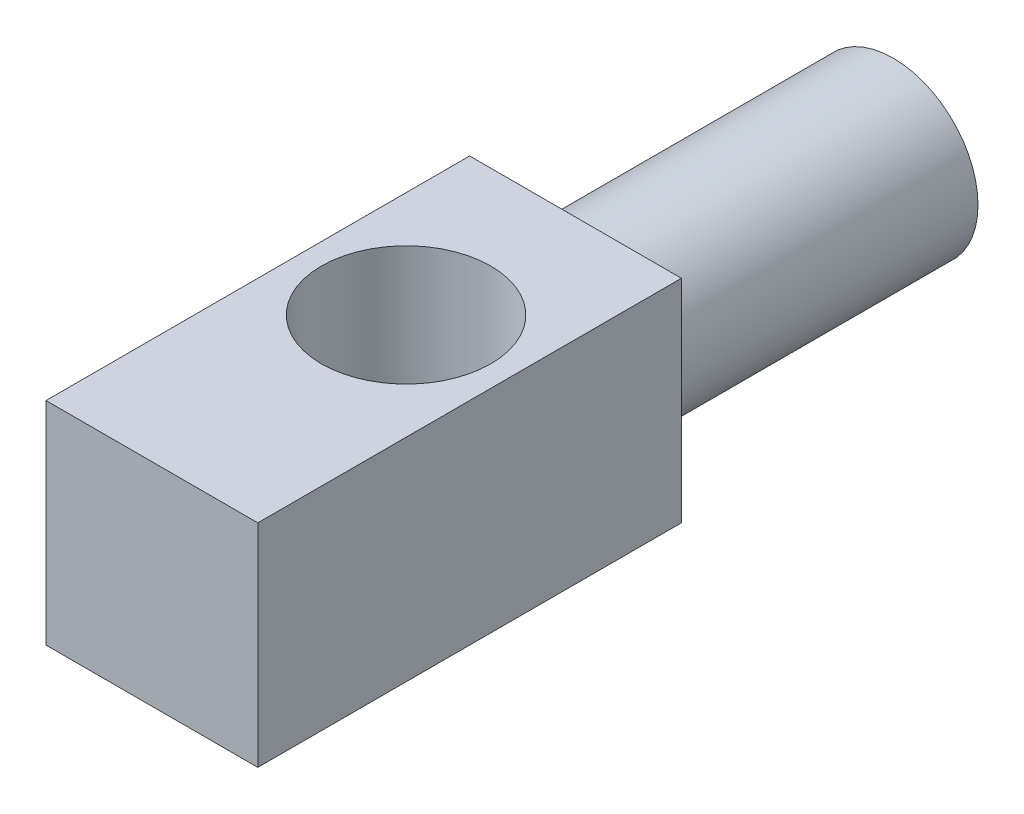
ISO-10303-21;
HEADER;
FILE_DESCRIPTION(('STEP AP214'),'2;1');
FILE_NAME('part.step','',(''),(''),'','','');
FILE_SCHEMA(('AUTOMOTIVE_DESIGN { 1 0 10303 214 1 1 1 1 }'));
ENDSEC;
DATA;
#1=APPLICATION_CONTEXT('core data for automotive mechanical design processes');
#2=APPLICATION_PROTOCOL_DEFINITION('international standard','automotive_design',2000,#1);
#3=PRODUCT_CONTEXT('',#1,'mechanical');
#4=PRODUCT('Part','Part','',(#3));
#5=PRODUCT_RELATED_PRODUCT_CATEGORY('part','',(#4));
#6=PRODUCT_DEFINITION_FORMATION('','',#4);
#7=PRODUCT_DEFINITION_CONTEXT('part definition',#1,'design');
#8=PRODUCT_DEFINITION('design','',#6,#7);
#9=PRODUCT_DEFINITION_SHAPE('','',#8);
#10=(LENGTH_UNIT() NAMED_UNIT(*) SI_UNIT(.MILLI.,.METRE.));
#11=(NAMED_UNIT(*) PLANE_ANGLE_UNIT() SI_UNIT($,.RADIAN.));
#12=(NAMED_UNIT(*) SI_UNIT($,.STERADIAN.) SOLID_ANGLE_UNIT());
#13=UNCERTAINTY_MEASURE_WITH_UNIT(LENGTH_MEASURE(1.E-05),#10,'distance_accuracy_value','');
#14=(GEOMETRIC_REPRESENTATION_CONTEXT(3) GLOBAL_UNCERTAINTY_ASSIGNED_CONTEXT((#13)) GLOBAL_UNIT_ASSIGNED_CONTEXT((#10,
#11,#12)) REPRESENTATION_CONTEXT('',''));
#15=CARTESIAN_POINT('',(0.,0.,0.));
#16=DIRECTION('',(0.,0.,1.));
#17=DIRECTION('',(1.,0.,0.));
#18=AXIS2_PLACEMENT_3D('',#15,#16,#17);
#19=CARTESIAN_POINT('',(0.,50.,0.));
#20=DIRECTION('',(0.,1.,0.));
#21=DIRECTION('',(0.,0.,1.));
#22=AXIS2_PLACEMENT_3D('',#19,#20,#21);
#23=PLANE('',#22);
#24=DIRECTION('',(-1.,0.,0.));
#25=VECTOR('',#24,1.);
#26=CARTESIAN_POINT('',(25.,50.,-40.));
#27=LINE('',#26,#25);
#28=CARTESIAN_POINT('',(25.,50.,-40.));
#29=VERTEX_POINT('',#28);
#30=CARTESIAN_POINT('',(-25.,50.,-40.));
#31=VERTEX_POINT('',#30);
#32=EDGE_CURVE('E93',#29,#31,#27,.T.);
#33=ORIENTED_EDGE('',*,*,#32,.T.);
#34=DIRECTION('',(0.,0.,1.));
#35=VECTOR('',#34,1.);
#36=CARTESIAN_POINT('',(-25.,50.,-40.));
#37=LINE('',#36,#35);
#38=CARTESIAN_POINT('',(-25.,50.,60.));
#39=VERTEX_POINT('',#38);
#40=EDGE_CURVE('E88',#31,#39,#37,.T.);
#41=ORIENTED_EDGE('',*,*,#40,.T.);
#42=DIRECTION('',(1.,0.,0.));
#43=VECTOR('',#42,1.);
#44=CARTESIAN_POINT('',(-25.,50.,60.));
#45=LINE('',#44,#43);
#46=CARTESIAN_POINT('',(25.,50.,60.));
#47=VERTEX_POINT('',#46);
#48=EDGE_CURVE('E91',#39,#47,#45,.T.);
#49=ORIENTED_EDGE('',*,*,#48,.T.);
#50=DIRECTION('',(0.,0.,-1.));
#51=VECTOR('',#50,1.);
#52=CARTESIAN_POINT('',(25.,50.,60.));
#53=LINE('',#52,#51);
#54=EDGE_CURVE('E57',#47,#29,#53,.T.);
#55=ORIENTED_EDGE('',*,*,#54,.T.);
#56=EDGE_LOOP('',(#33,#41,#49,#55));
#57=FACE_BOUND('',#56,.T.);
#58=CARTESIAN_POINT('',(0.,50.,0.));
#59=DIRECTION('',(0.,1.,0.));
#60=DIRECTION('',(0.,0.,1.));
#61=AXIS2_PLACEMENT_3D('',#58,#59,#60);
#62=CIRCLE('',#61,20.);
#63=CARTESIAN_POINT('',(0.,50.,20.));
#64=VERTEX_POINT('',#63);
#65=EDGE_CURVE('E109',#64,#64,#62,.T.);
#66=ORIENTED_EDGE('',*,*,#65,.F.);
#67=EDGE_LOOP('',(#66));
#68=FACE_BOUND('',#67,.T.);
#69=ADVANCED_FACE('F39',(#57,#68),#23,.T.);
#70=CARTESIAN_POINT('',(0.,0.,0.));
#71=DIRECTION('',(0.,1.,0.));
#72=DIRECTION('',(0.,0.,1.));
#73=AXIS2_PLACEMENT_3D('',#70,#71,#72);
#74=PLANE('',#73);
#75=DIRECTION('',(-1.,0.,0.));
#76=VECTOR('',#75,1.);
#77=CARTESIAN_POINT('',(25.,0.,-40.));
#78=LINE('',#77,#76);
#79=CARTESIAN_POINT('',(25.,0.,-40.));
#80=VERTEX_POINT('',#79);
#81=CARTESIAN_POINT('',(-25.,0.,-40.));
#82=VERTEX_POINT('',#81);
#83=EDGE_CURVE('E106',#80,#82,#78,.T.);
#84=ORIENTED_EDGE('',*,*,#83,.F.);
#85=DIRECTION('',(0.,0.,-1.));
#86=VECTOR('',#85,1.);
#87=CARTESIAN_POINT('',(25.,0.,60.));
#88=LINE('',#87,#86);
#89=CARTESIAN_POINT('',(25.,0.,60.));
#90=VERTEX_POINT('',#89);
#91=EDGE_CURVE('E80',#90,#80,#88,.T.);
#92=ORIENTED_EDGE('',*,*,#91,.F.);
#93=DIRECTION('',(1.,0.,0.));
#94=VECTOR('',#93,1.);
#95=CARTESIAN_POINT('',(-25.,0.,60.));
#96=LINE('',#95,#94);
#97=CARTESIAN_POINT('',(-25.,0.,60.));
#98=VERTEX_POINT('',#97);
#99=EDGE_CURVE('E74',#98,#90,#96,.T.);
#100=ORIENTED_EDGE('',*,*,#99,.F.);
#101=DIRECTION('',(0.,0.,1.));
#102=VECTOR('',#101,1.);
#103=CARTESIAN_POINT('',(-25.,0.,-40.));
#104=LINE('',#103,#102);
#105=EDGE_CURVE('E98',#82,#98,#104,.T.);
#106=ORIENTED_EDGE('',*,*,#105,.F.);
#107=EDGE_LOOP('',(#84,#92,#100,#106));
#108=FACE_BOUND('',#107,.T.);
#109=CARTESIAN_POINT('',(0.,0.,0.));
#110=DIRECTION('',(0.,1.,0.));
#111=DIRECTION('',(0.,0.,1.));
#112=AXIS2_PLACEMENT_3D('',#109,#110,#111);
#113=CIRCLE('',#112,20.);
#114=CARTESIAN_POINT('',(0.,0.,20.));
#115=VERTEX_POINT('',#114);
#116=EDGE_CURVE('E121',#115,#115,#113,.T.);
#117=ORIENTED_EDGE('',*,*,#116,.T.);
#118=EDGE_LOOP('',(#117));
#119=FACE_BOUND('',#118,.T.);
#120=ADVANCED_FACE('F117',(#108,#119),#74,.F.);
#121=CARTESIAN_POINT('',(25.,50.,-40.));
#122=DIRECTION('',(0.,0.,1.));
#123=DIRECTION('',(1.,0.,0.));
#124=AXIS2_PLACEMENT_3D('',#121,#122,#123);
#125=PLANE('',#124);
#126=CARTESIAN_POINT('',(0.,25.,-40.));
#127=DIRECTION('',(0.,0.,-1.));
#128=DIRECTION('',(-1.,0.,0.));
#129=AXIS2_PLACEMENT_3D('',#126,#127,#128);
#130=CIRCLE('',#129,20.);
#131=CARTESIAN_POINT('',(-20.,25.,-40.));
#132=VERTEX_POINT('',#131);
#133=EDGE_CURVE('E11',#132,#132,#130,.T.);
#134=ORIENTED_EDGE('',*,*,#133,.F.);
#135=EDGE_LOOP('',(#134));
#136=FACE_BOUND('',#135,.T.);
#137=ORIENTED_EDGE('',*,*,#83,.T.);
#138=DIRECTION('',(0.,-1.,0.));
#139=VECTOR('',#138,1.);
#140=CARTESIAN_POINT('',(-25.,50.,-40.));
#141=LINE('',#140,#139);
#142=EDGE_CURVE('E43',#31,#82,#141,.T.);
#143=ORIENTED_EDGE('',*,*,#142,.F.);
#144=ORIENTED_EDGE('',*,*,#32,.F.);
#145=DIRECTION('',(0.,-1.,0.));
#146=VECTOR('',#145,1.);
#147=CARTESIAN_POINT('',(25.,50.,-40.));
#148=LINE('',#147,#146);
#149=EDGE_CURVE('E102',#29,#80,#148,.T.);
#150=ORIENTED_EDGE('',*,*,#149,.T.);
#151=EDGE_LOOP('',(#137,#143,#144,#150));
#152=FACE_BOUND('',#151,.T.);
#153=ADVANCED_FACE('F41',(#136,#152),#125,.F.);
#154=CARTESIAN_POINT('',(-25.,50.,-40.));
#155=DIRECTION('',(1.,0.,0.));
#156=DIRECTION('',(0.,0.,-1.));
#157=AXIS2_PLACEMENT_3D('',#154,#155,#156);
#158=PLANE('',#157);
#159=ORIENTED_EDGE('',*,*,#105,.T.);
#160=DIRECTION('',(0.,-1.,0.));
#161=VECTOR('',#160,1.);
#162=CARTESIAN_POINT('',(-25.,50.,60.));
#163=LINE('',#162,#161);
#164=EDGE_CURVE('E96',#39,#98,#163,.T.);
#165=ORIENTED_EDGE('',*,*,#164,.F.);
#166=ORIENTED_EDGE('',*,*,#40,.F.);
#167=ORIENTED_EDGE('',*,*,#142,.T.);
#168=EDGE_LOOP('',(#159,#165,#166,#167));
#169=FACE_BOUND('',#168,.T.);
#170=ADVANCED_FACE('F97',(#169),#158,.F.);
#171=CARTESIAN_POINT('',(-25.,50.,60.));
#172=DIRECTION('',(0.,0.,-1.));
#173=DIRECTION('',(-1.,0.,0.));
#174=AXIS2_PLACEMENT_3D('',#171,#172,#173);
#175=PLANE('',#174);
#176=ORIENTED_EDGE('',*,*,#99,.T.);
#177=DIRECTION('',(0.,-1.,0.));
#178=VECTOR('',#177,1.);
#179=CARTESIAN_POINT('',(25.,50.,60.));
#180=LINE('',#179,#178);
#181=EDGE_CURVE('E99',#47,#90,#180,.T.);
#182=ORIENTED_EDGE('',*,*,#181,.F.);
#183=ORIENTED_EDGE('',*,*,#48,.F.);
#184=ORIENTED_EDGE('',*,*,#164,.T.);
#185=EDGE_LOOP('',(#176,#182,#183,#184));
#186=FACE_BOUND('',#185,.T.);
#187=ADVANCED_FACE('F100',(#186),#175,.F.);
#188=CARTESIAN_POINT('',(25.,50.,60.));
#189=DIRECTION('',(-1.,0.,0.));
#190=DIRECTION('',(0.,0.,1.));
#191=AXIS2_PLACEMENT_3D('',#188,#189,#190);
#192=PLANE('',#191);
#193=ORIENTED_EDGE('',*,*,#91,.T.);
#194=ORIENTED_EDGE('',*,*,#149,.F.);
#195=ORIENTED_EDGE('',*,*,#54,.F.);
#196=ORIENTED_EDGE('',*,*,#181,.T.);
#197=EDGE_LOOP('',(#193,#194,#195,#196));
#198=FACE_BOUND('',#197,.T.);
#199=ADVANCED_FACE('F114',(#198),#192,.F.);
#200=CARTESIAN_POINT('',(0.,50.,0.));
#201=DIRECTION('',(0.,-1.,0.));
#202=DIRECTION('',(0.,0.,-1.));
#203=AXIS2_PLACEMENT_3D('',#200,#201,#202);
#204=CYLINDRICAL_SURFACE('',#203,20.);
#205=ORIENTED_EDGE('',*,*,#65,.T.);
#206=EDGE_LOOP('',(#205));
#207=FACE_BOUND('',#206,.T.);
#208=ORIENTED_EDGE('',*,*,#116,.F.);
#209=EDGE_LOOP('',(#208));
#210=FACE_BOUND('',#209,.T.);
#211=ADVANCED_FACE('F135',(#207,#210),#204,.F.);
#212=CARTESIAN_POINT('',(0.,25.,-115.));
#213=DIRECTION('',(0.,0.,1.));
#214=DIRECTION('',(1.,0.,0.));
#215=AXIS2_PLACEMENT_3D('',#212,#213,#214);
#216=CYLINDRICAL_SURFACE('',#215,20.);
#217=CARTESIAN_POINT('',(0.,25.,-115.));
#218=DIRECTION('',(0.,0.,-1.));
#219=DIRECTION('',(-1.,0.,0.));
#220=AXIS2_PLACEMENT_3D('',#217,#218,#219);
#221=CIRCLE('',#220,20.);
#222=CARTESIAN_POINT('',(-20.,25.,-115.));
#223=VERTEX_POINT('',#222);
#224=EDGE_CURVE('E124',#223,#223,#221,.T.);
#225=ORIENTED_EDGE('',*,*,#224,.F.);
#226=EDGE_LOOP('',(#225));
#227=FACE_BOUND('',#226,.T.);
#228=ORIENTED_EDGE('',*,*,#133,.T.);
#229=EDGE_LOOP('',(#228));
#230=FACE_BOUND('',#229,.T.);
#231=ADVANCED_FACE('F132',(#227,#230),#216,.T.);
#232=CARTESIAN_POINT('',(0.,25.,-115.));
#233=DIRECTION('',(0.,0.,-1.));
#234=DIRECTION('',(-1.,0.,0.));
#235=AXIS2_PLACEMENT_3D('',#232,#233,#234);
#236=PLANE('',#235);
#237=ORIENTED_EDGE('',*,*,#224,.T.);
#238=EDGE_LOOP('',(#237));
#239=FACE_BOUND('',#238,.T.);
#240=ADVANCED_FACE('F130',(#239),#236,.T.);
#241=CLOSED_SHELL('',(#69,#120,#153,#170,#187,#199,#211,#231,#240));
#242=MANIFOLD_SOLID_BREP('B2',#241);
#243=ADVANCED_BREP_SHAPE_REPRESENTATION('',(#18,#242),#14);
#244=SHAPE_DEFINITION_REPRESENTATION(#9,#243);
ENDSEC;
END-ISO-10303-21;
